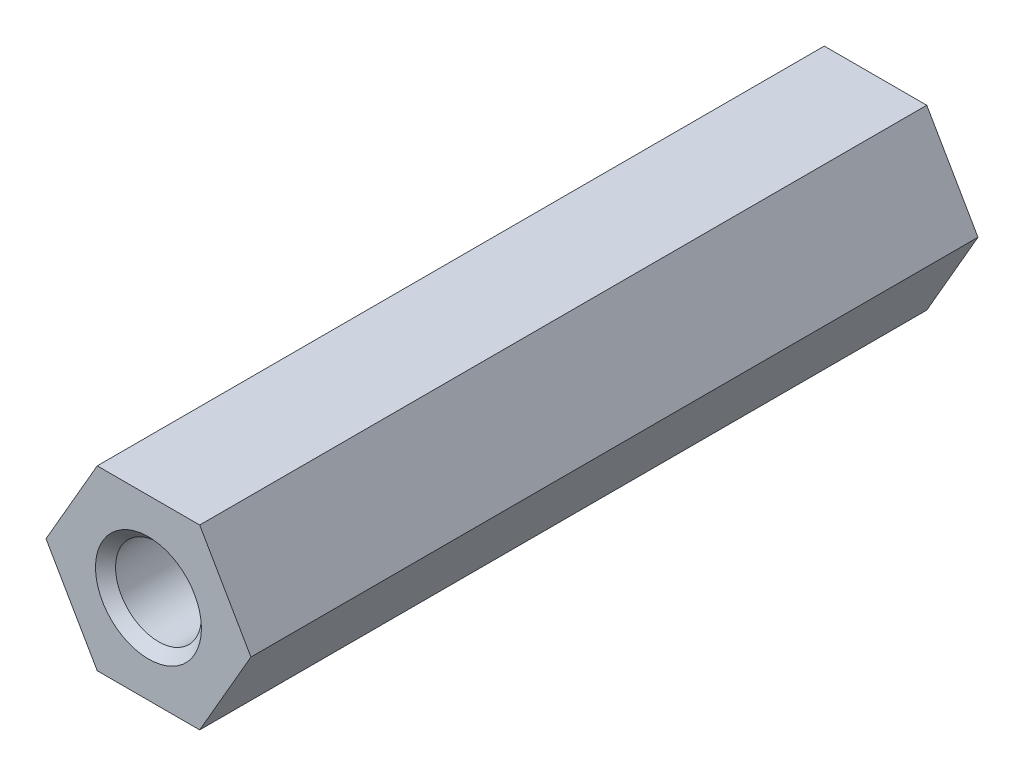
ISO-10303-21;
HEADER;
FILE_DESCRIPTION(('STEP AP214'),'2;1');
FILE_NAME('part.step','',(''),(''),'','','');
FILE_SCHEMA(('AUTOMOTIVE_DESIGN { 1 0 10303 214 1 1 1 1 }'));
ENDSEC;
DATA;
#1=APPLICATION_CONTEXT('core data for automotive mechanical design processes');
#2=APPLICATION_PROTOCOL_DEFINITION('international standard','automotive_design',2000,#1);
#3=PRODUCT_CONTEXT('',#1,'mechanical');
#4=PRODUCT('Part','Part','',(#3));
#5=PRODUCT_RELATED_PRODUCT_CATEGORY('part','',(#4));
#6=PRODUCT_DEFINITION_FORMATION('','',#4);
#7=PRODUCT_DEFINITION_CONTEXT('part definition',#1,'design');
#8=PRODUCT_DEFINITION('design','',#6,#7);
#9=PRODUCT_DEFINITION_SHAPE('','',#8);
#10=(LENGTH_UNIT() NAMED_UNIT(*) SI_UNIT(.MILLI.,.METRE.));
#11=(NAMED_UNIT(*) PLANE_ANGLE_UNIT() SI_UNIT($,.RADIAN.));
#12=(NAMED_UNIT(*) SI_UNIT($,.STERADIAN.) SOLID_ANGLE_UNIT());
#13=UNCERTAINTY_MEASURE_WITH_UNIT(LENGTH_MEASURE(1.E-05),#10,'distance_accuracy_value','');
#14=(GEOMETRIC_REPRESENTATION_CONTEXT(3) GLOBAL_UNCERTAINTY_ASSIGNED_CONTEXT((#13)) GLOBAL_UNIT_ASSIGNED_CONTEXT((#10,
#11,#12)) REPRESENTATION_CONTEXT('',''));
#15=CARTESIAN_POINT('',(0.,0.,0.));
#16=DIRECTION('',(0.,0.,1.));
#17=DIRECTION('',(1.,0.,0.));
#18=AXIS2_PLACEMENT_3D('',#15,#16,#17);
#19=CARTESIAN_POINT('',(1.78978583448784,-3.1,0.));
#20=DIRECTION('',(0.866025403784439,-0.5,0.));
#21=DIRECTION('',(0.5,0.866025403784439,0.));
#22=AXIS2_PLACEMENT_3D('',#19,#20,#21);
#23=PLANE('',#22);
#24=DIRECTION('',(0.5,0.866025403784439,0.));
#25=VECTOR('',#24,1.);
#26=CARTESIAN_POINT('',(1.78978583448784,-3.1,25.4));
#27=LINE('',#26,#25);
#28=CARTESIAN_POINT('',(1.78978583448784,-3.1,25.4));
#29=VERTEX_POINT('',#28);
#30=CARTESIAN_POINT('',(3.57957166897568,0.,25.4));
#31=VERTEX_POINT('',#30);
#32=EDGE_CURVE('E81',#29,#31,#27,.T.);
#33=ORIENTED_EDGE('',*,*,#32,.F.);
#34=DIRECTION('',(0.,0.,-1.));
#35=VECTOR('',#34,1.);
#36=CARTESIAN_POINT('',(1.78978583448784,-3.1,0.));
#37=LINE('',#36,#35);
#38=CARTESIAN_POINT('',(1.78978583448784,-3.1,0.));
#39=VERTEX_POINT('',#38);
#40=EDGE_CURVE('E69',#39,#29,#37,.F.);
#41=ORIENTED_EDGE('',*,*,#40,.F.);
#42=DIRECTION('',(0.5,0.866025403784439,0.));
#43=VECTOR('',#42,1.);
#44=CARTESIAN_POINT('',(1.78978583448784,-3.1,0.));
#45=LINE('',#44,#43);
#46=CARTESIAN_POINT('',(3.57957166897568,0.,0.));
#47=VERTEX_POINT('',#46);
#48=EDGE_CURVE('E123',#39,#47,#45,.T.);
#49=ORIENTED_EDGE('',*,*,#48,.T.);
#50=DIRECTION('',(0.,0.,1.));
#51=VECTOR('',#50,1.);
#52=CARTESIAN_POINT('',(3.57957166897568,0.,0.));
#53=LINE('',#52,#51);
#54=EDGE_CURVE('E85',#31,#47,#53,.F.);
#55=ORIENTED_EDGE('',*,*,#54,.F.);
#56=EDGE_LOOP('',(#33,#41,#49,#55));
#57=FACE_BOUND('',#56,.T.);
#58=ADVANCED_FACE('F16',(#57),#23,.T.);
#59=CARTESIAN_POINT('',(3.57957166897568,0.,0.));
#60=DIRECTION('',(0.866025403784438,0.5,0.));
#61=DIRECTION('',(-0.5,0.866025403784438,0.));
#62=AXIS2_PLACEMENT_3D('',#59,#60,#61);
#63=PLANE('',#62);
#64=DIRECTION('',(-0.5,0.866025403784439,0.));
#65=VECTOR('',#64,1.);
#66=CARTESIAN_POINT('',(3.57957166897568,0.,25.4));
#67=LINE('',#66,#65);
#68=CARTESIAN_POINT('',(1.78978583448784,3.1,25.4));
#69=VERTEX_POINT('',#68);
#70=EDGE_CURVE('E87',#31,#69,#67,.T.);
#71=ORIENTED_EDGE('',*,*,#70,.F.);
#72=ORIENTED_EDGE('',*,*,#54,.T.);
#73=DIRECTION('',(-0.5,0.866025403784439,0.));
#74=VECTOR('',#73,1.);
#75=CARTESIAN_POINT('',(3.57957166897568,0.,0.));
#76=LINE('',#75,#74);
#77=CARTESIAN_POINT('',(1.78978583448784,3.1,0.));
#78=VERTEX_POINT('',#77);
#79=EDGE_CURVE('E120',#47,#78,#76,.T.);
#80=ORIENTED_EDGE('',*,*,#79,.T.);
#81=DIRECTION('',(0.,0.,1.));
#82=VECTOR('',#81,1.);
#83=CARTESIAN_POINT('',(1.78978583448784,3.1,0.));
#84=LINE('',#83,#82);
#85=EDGE_CURVE('E97',#69,#78,#84,.F.);
#86=ORIENTED_EDGE('',*,*,#85,.F.);
#87=EDGE_LOOP('',(#71,#72,#80,#86));
#88=FACE_BOUND('',#87,.T.);
#89=ADVANCED_FACE('F226',(#88),#63,.T.);
#90=CARTESIAN_POINT('',(1.78978583448784,3.1,0.));
#91=DIRECTION('',(0.,1.,0.));
#92=DIRECTION('',(0.,0.,1.));
#93=AXIS2_PLACEMENT_3D('',#90,#91,#92);
#94=PLANE('',#93);
#95=DIRECTION('',(1.,0.,0.));
#96=VECTOR('',#95,1.);
#97=CARTESIAN_POINT('',(0.,3.1,25.4));
#98=LINE('',#97,#96);
#99=CARTESIAN_POINT('',(-1.78978583448784,3.1,25.4));
#100=VERTEX_POINT('',#99);
#101=EDGE_CURVE('E89',#69,#100,#98,.F.);
#102=ORIENTED_EDGE('',*,*,#101,.F.);
#103=ORIENTED_EDGE('',*,*,#85,.T.);
#104=DIRECTION('',(1.,0.,0.));
#105=VECTOR('',#104,1.);
#106=CARTESIAN_POINT('',(0.,3.1,0.));
#107=LINE('',#106,#105);
#108=CARTESIAN_POINT('',(-1.78978583448784,3.1,0.));
#109=VERTEX_POINT('',#108);
#110=EDGE_CURVE('E117',#78,#109,#107,.F.);
#111=ORIENTED_EDGE('',*,*,#110,.T.);
#112=DIRECTION('',(0.,0.,1.));
#113=VECTOR('',#112,1.);
#114=CARTESIAN_POINT('',(-1.78978583448784,3.1,0.));
#115=LINE('',#114,#113);
#116=EDGE_CURVE('E95',#100,#109,#115,.F.);
#117=ORIENTED_EDGE('',*,*,#116,.F.);
#118=EDGE_LOOP('',(#102,#103,#111,#117));
#119=FACE_BOUND('',#118,.T.);
#120=ADVANCED_FACE('F133',(#119),#94,.T.);
#121=CARTESIAN_POINT('',(-1.78978583448784,3.1,0.));
#122=DIRECTION('',(-0.866025403784439,0.5,0.));
#123=DIRECTION('',(-0.5,-0.866025403784439,0.));
#124=AXIS2_PLACEMENT_3D('',#121,#122,#123);
#125=PLANE('',#124);
#126=DIRECTION('',(-0.5,-0.866025403784439,0.));
#127=VECTOR('',#126,1.);
#128=CARTESIAN_POINT('',(-1.78978583448784,3.1,25.4));
#129=LINE('',#128,#127);
#130=CARTESIAN_POINT('',(-3.57957166897568,0.,25.4));
#131=VERTEX_POINT('',#130);
#132=EDGE_CURVE('E126',#100,#131,#129,.T.);
#133=ORIENTED_EDGE('',*,*,#132,.F.);
#134=ORIENTED_EDGE('',*,*,#116,.T.);
#135=DIRECTION('',(-0.5,-0.866025403784439,0.));
#136=VECTOR('',#135,1.);
#137=CARTESIAN_POINT('',(-1.78978583448784,3.1,0.));
#138=LINE('',#137,#136);
#139=CARTESIAN_POINT('',(-3.57957166897568,0.,0.));
#140=VERTEX_POINT('',#139);
#141=EDGE_CURVE('E110',#109,#140,#138,.T.);
#142=ORIENTED_EDGE('',*,*,#141,.T.);
#143=DIRECTION('',(0.,0.,1.));
#144=VECTOR('',#143,1.);
#145=CARTESIAN_POINT('',(-3.57957166897568,0.,0.));
#146=LINE('',#145,#144);
#147=EDGE_CURVE('E77',#131,#140,#146,.F.);
#148=ORIENTED_EDGE('',*,*,#147,.F.);
#149=EDGE_LOOP('',(#133,#134,#142,#148));
#150=FACE_BOUND('',#149,.T.);
#151=ADVANCED_FACE('F137',(#150),#125,.T.);
#152=CARTESIAN_POINT('',(-3.57957166897568,0.,0.));
#153=DIRECTION('',(-0.866025403784439,-0.5,0.));
#154=DIRECTION('',(0.5,-0.866025403784439,0.));
#155=AXIS2_PLACEMENT_3D('',#152,#153,#154);
#156=PLANE('',#155);
#157=DIRECTION('',(0.5,-0.866025403784439,0.));
#158=VECTOR('',#157,1.);
#159=CARTESIAN_POINT('',(-3.57957166897568,0.,25.4));
#160=LINE('',#159,#158);
#161=CARTESIAN_POINT('',(-1.78978583448784,-3.1,25.4));
#162=VERTEX_POINT('',#161);
#163=EDGE_CURVE('E83',#131,#162,#160,.T.);
#164=ORIENTED_EDGE('',*,*,#163,.F.);
#165=ORIENTED_EDGE('',*,*,#147,.T.);
#166=DIRECTION('',(0.5,-0.866025403784439,0.));
#167=VECTOR('',#166,1.);
#168=CARTESIAN_POINT('',(-3.57957166897568,0.,0.));
#169=LINE('',#168,#167);
#170=CARTESIAN_POINT('',(-1.78978583448784,-3.1,0.));
#171=VERTEX_POINT('',#170);
#172=EDGE_CURVE('E108',#140,#171,#169,.T.);
#173=ORIENTED_EDGE('',*,*,#172,.T.);
#174=DIRECTION('',(0.,0.,-1.));
#175=VECTOR('',#174,1.);
#176=CARTESIAN_POINT('',(-1.78978583448784,-3.1,0.));
#177=LINE('',#176,#175);
#178=EDGE_CURVE('E34',#162,#171,#177,.T.);
#179=ORIENTED_EDGE('',*,*,#178,.F.);
#180=EDGE_LOOP('',(#164,#165,#173,#179));
#181=FACE_BOUND('',#180,.T.);
#182=ADVANCED_FACE('F139',(#181),#156,.T.);
#183=CARTESIAN_POINT('',(-1.78978583448784,-3.1,0.));
#184=DIRECTION('',(0.,-1.,0.));
#185=DIRECTION('',(0.,0.,-1.));
#186=AXIS2_PLACEMENT_3D('',#183,#184,#185);
#187=PLANE('',#186);
#188=DIRECTION('',(1.,0.,0.));
#189=VECTOR('',#188,1.);
#190=CARTESIAN_POINT('',(0.,-3.1,25.4));
#191=LINE('',#190,#189);
#192=EDGE_CURVE('E72',#162,#29,#191,.T.);
#193=ORIENTED_EDGE('',*,*,#192,.F.);
#194=ORIENTED_EDGE('',*,*,#178,.T.);
#195=DIRECTION('',(1.,0.,0.));
#196=VECTOR('',#195,1.);
#197=CARTESIAN_POINT('',(0.,-3.1,0.));
#198=LINE('',#197,#196);
#199=EDGE_CURVE('E73',#171,#39,#198,.T.);
#200=ORIENTED_EDGE('',*,*,#199,.T.);
#201=ORIENTED_EDGE('',*,*,#40,.T.);
#202=EDGE_LOOP('',(#193,#194,#200,#201));
#203=FACE_BOUND('',#202,.T.);
#204=ADVANCED_FACE('F71',(#203),#187,.T.);
#205=CARTESIAN_POINT('',(0.,0.,25.4));
#206=DIRECTION('',(0.,0.,1.));
#207=DIRECTION('',(1.,0.,0.));
#208=AXIS2_PLACEMENT_3D('',#205,#206,#207);
#209=PLANE('',#208);
#210=CARTESIAN_POINT('',(0.,0.,25.3999999999905));
#211=DIRECTION('',(0.,0.,1.));
#212=DIRECTION('',(1.,0.,0.));
#213=AXIS2_PLACEMENT_3D('',#210,#211,#212);
#214=CIRCLE('',#213,1.8500000000472);
#215=CARTESIAN_POINT('',(1.8500000000472,0.,25.3999999999905));
#216=VERTEX_POINT('',#215);
#217=EDGE_CURVE('E19',#216,#216,#214,.F.);
#218=ORIENTED_EDGE('',*,*,#217,.T.);
#219=EDGE_LOOP('',(#218));
#220=FACE_BOUND('',#219,.T.);
#221=ORIENTED_EDGE('',*,*,#132,.T.);
#222=ORIENTED_EDGE('',*,*,#163,.T.);
#223=ORIENTED_EDGE('',*,*,#192,.T.);
#224=ORIENTED_EDGE('',*,*,#32,.T.);
#225=ORIENTED_EDGE('',*,*,#70,.T.);
#226=ORIENTED_EDGE('',*,*,#101,.T.);
#227=EDGE_LOOP('',(#221,#222,#223,#224,#225,#226));
#228=FACE_BOUND('',#227,.T.);
#229=ADVANCED_FACE('F80',(#220,#228),#209,.T.);
#230=CARTESIAN_POINT('',(0.,0.,0.));
#231=DIRECTION('',(0.,0.,1.));
#232=DIRECTION('',(1.,0.,0.));
#233=AXIS2_PLACEMENT_3D('',#230,#231,#232);
#234=PLANE('',#233);
#235=CARTESIAN_POINT('',(0.,0.,0.));
#236=DIRECTION('',(0.,0.,-1.));
#237=DIRECTION('',(-1.,0.,0.));
#238=AXIS2_PLACEMENT_3D('',#235,#236,#237);
#239=CIRCLE('',#238,1.84999999999036);
#240=CARTESIAN_POINT('',(-1.84999999999036,0.,0.));
#241=VERTEX_POINT('',#240);
#242=EDGE_CURVE('E99',#241,#241,#239,.F.);
#243=ORIENTED_EDGE('',*,*,#242,.T.);
#244=EDGE_LOOP('',(#243));
#245=FACE_BOUND('',#244,.T.);
#246=ORIENTED_EDGE('',*,*,#172,.F.);
#247=ORIENTED_EDGE('',*,*,#141,.F.);
#248=ORIENTED_EDGE('',*,*,#110,.F.);
#249=ORIENTED_EDGE('',*,*,#79,.F.);
#250=ORIENTED_EDGE('',*,*,#48,.F.);
#251=ORIENTED_EDGE('',*,*,#199,.F.);
#252=EDGE_LOOP('',(#246,#247,#248,#249,#250,#251));
#253=FACE_BOUND('',#252,.T.);
#254=ADVANCED_FACE('F165',(#245,#253),#234,.F.);
#255=CARTESIAN_POINT('',(0.,0.,25.3999999999905));
#256=DIRECTION('',(0.,0.,1.));
#257=DIRECTION('',(1.,0.,0.));
#258=AXIS2_PLACEMENT_3D('',#255,#256,#257);
#259=CONICAL_SURFACE('',#258,1.8500000000472,0.785398163397448);
#260=CARTESIAN_POINT('',(0.,0.,25.05));
#261=DIRECTION('',(0.,0.,-1.));
#262=DIRECTION('',(-1.,0.,0.));
#263=AXIS2_PLACEMENT_3D('',#260,#261,#262);
#264=CIRCLE('',#263,1.5);
#265=CARTESIAN_POINT('',(-1.5,0.,25.05));
#266=VERTEX_POINT('',#265);
#267=EDGE_CURVE('E25',#266,#266,#264,.T.);
#268=ORIENTED_EDGE('',*,*,#267,.T.);
#269=EDGE_LOOP('',(#268));
#270=FACE_BOUND('',#269,.T.);
#271=ORIENTED_EDGE('',*,*,#217,.F.);
#272=EDGE_LOOP('',(#271));
#273=FACE_BOUND('',#272,.T.);
#274=ADVANCED_FACE('F157',(#270,#273),#259,.F.);
#275=CARTESIAN_POINT('',(0.,0.,5.6843418860808E-11));
#276=DIRECTION('',(0.,0.,-1.));
#277=DIRECTION('',(-1.,0.,0.));
#278=AXIS2_PLACEMENT_3D('',#275,#276,#277);
#279=CONICAL_SURFACE('',#278,1.84999999993352,0.785398163397448);
#280=CARTESIAN_POINT('',(0.,0.,0.35));
#281=DIRECTION('',(0.,0.,-1.));
#282=DIRECTION('',(-1.,0.,0.));
#283=AXIS2_PLACEMENT_3D('',#280,#281,#282);
#284=CIRCLE('',#283,1.5);
#285=CARTESIAN_POINT('',(-1.5,0.,0.35));
#286=VERTEX_POINT('',#285);
#287=EDGE_CURVE('E11',#286,#286,#284,.F.);
#288=ORIENTED_EDGE('',*,*,#287,.T.);
#289=EDGE_LOOP('',(#288));
#290=FACE_BOUND('',#289,.T.);
#291=ORIENTED_EDGE('',*,*,#242,.F.);
#292=EDGE_LOOP('',(#291));
#293=FACE_BOUND('',#292,.T.);
#294=ADVANCED_FACE('F151',(#290,#293),#279,.F.);
#295=CARTESIAN_POINT('',(0.,0.,25.4));
#296=DIRECTION('',(0.,0.,-1.));
#297=DIRECTION('',(-1.,0.,0.));
#298=AXIS2_PLACEMENT_3D('',#295,#296,#297);
#299=CYLINDRICAL_SURFACE('',#298,1.5);
#300=ORIENTED_EDGE('',*,*,#287,.F.);
#301=EDGE_LOOP('',(#300));
#302=FACE_BOUND('',#301,.T.);
#303=ORIENTED_EDGE('',*,*,#267,.F.);
#304=EDGE_LOOP('',(#303));
#305=FACE_BOUND('',#304,.T.);
#306=ADVANCED_FACE('F149',(#302,#305),#299,.F.);
#307=CLOSED_SHELL('',(#58,#89,#120,#151,#182,#204,#229,#254,#274,#294,#306));
#308=MANIFOLD_SOLID_BREP('B1',#307);
#309=ADVANCED_BREP_SHAPE_REPRESENTATION('',(#18,#308),#14);
#310=SHAPE_DEFINITION_REPRESENTATION(#9,#309);
ENDSEC;
END-ISO-10303-21;
